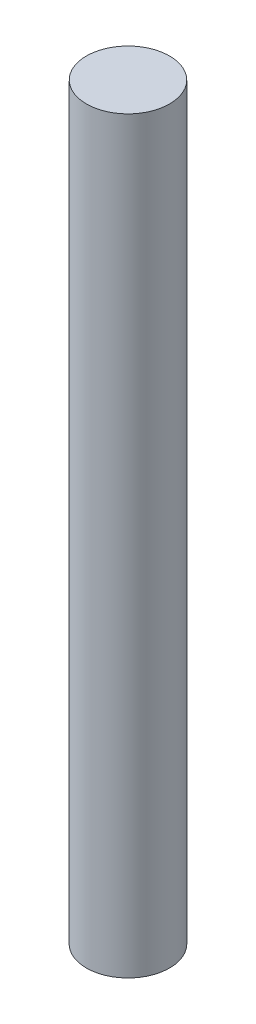
ISO-10303-21;
HEADER;
FILE_DESCRIPTION(('STEP AP214'),'2;1');
FILE_NAME('part.step','',(''),(''),'','','');
FILE_SCHEMA(('AUTOMOTIVE_DESIGN { 1 0 10303 214 1 1 1 1 }'));
ENDSEC;
DATA;
#1=APPLICATION_CONTEXT('core data for automotive mechanical design processes');
#2=APPLICATION_PROTOCOL_DEFINITION('international standard','automotive_design',2000,#1);
#3=PRODUCT_CONTEXT('',#1,'mechanical');
#4=PRODUCT('Part','Part','',(#3));
#5=PRODUCT_RELATED_PRODUCT_CATEGORY('part','',(#4));
#6=PRODUCT_DEFINITION_FORMATION('','',#4);
#7=PRODUCT_DEFINITION_CONTEXT('part definition',#1,'design');
#8=PRODUCT_DEFINITION('design','',#6,#7);
#9=PRODUCT_DEFINITION_SHAPE('','',#8);
#10=(LENGTH_UNIT() NAMED_UNIT(*) SI_UNIT(.MILLI.,.METRE.));
#11=(NAMED_UNIT(*) PLANE_ANGLE_UNIT() SI_UNIT($,.RADIAN.));
#12=(NAMED_UNIT(*) SI_UNIT($,.STERADIAN.) SOLID_ANGLE_UNIT());
#13=UNCERTAINTY_MEASURE_WITH_UNIT(LENGTH_MEASURE(1.E-05),#10,'distance_accuracy_value','');
#14=(GEOMETRIC_REPRESENTATION_CONTEXT(3) GLOBAL_UNCERTAINTY_ASSIGNED_CONTEXT((#13)) GLOBAL_UNIT_ASSIGNED_CONTEXT((#10,
#11,#12)) REPRESENTATION_CONTEXT('',''));
#15=CARTESIAN_POINT('',(0.,0.,0.));
#16=DIRECTION('',(0.,0.,1.));
#17=DIRECTION('',(1.,0.,0.));
#18=AXIS2_PLACEMENT_3D('',#15,#16,#17);
#19=CARTESIAN_POINT('',(0.,57.15,0.));
#20=DIRECTION('',(0.,-1.,0.));
#21=DIRECTION('',(0.,0.,-1.));
#22=AXIS2_PLACEMENT_3D('',#19,#20,#21);
#23=CYLINDRICAL_SURFACE('',#22,6.35);
#24=CARTESIAN_POINT('',(0.,57.15,0.));
#25=DIRECTION('',(0.,1.,0.));
#26=DIRECTION('',(0.,0.,1.));
#27=AXIS2_PLACEMENT_3D('',#24,#25,#26);
#28=CIRCLE('',#27,6.35);
#29=CARTESIAN_POINT('',(0.,57.15,6.35));
#30=VERTEX_POINT('',#29);
#31=EDGE_CURVE('E10',#30,#30,#28,.T.);
#32=ORIENTED_EDGE('',*,*,#31,.F.);
#33=EDGE_LOOP('',(#32));
#34=FACE_BOUND('',#33,.T.);
#35=CARTESIAN_POINT('',(0.,-57.15,0.));
#36=DIRECTION('',(0.,1.,0.));
#37=DIRECTION('',(0.,0.,1.));
#38=AXIS2_PLACEMENT_3D('',#35,#36,#37);
#39=CIRCLE('',#38,6.35);
#40=CARTESIAN_POINT('',(0.,-57.15,6.35));
#41=VERTEX_POINT('',#40);
#42=EDGE_CURVE('E46',#41,#41,#39,.T.);
#43=ORIENTED_EDGE('',*,*,#42,.T.);
#44=EDGE_LOOP('',(#43));
#45=FACE_BOUND('',#44,.T.);
#46=ADVANCED_FACE('F43',(#34,#45),#23,.T.);
#47=CARTESIAN_POINT('',(0.,57.15,0.));
#48=DIRECTION('',(0.,1.,0.));
#49=DIRECTION('',(0.,0.,1.));
#50=AXIS2_PLACEMENT_3D('',#47,#48,#49);
#51=PLANE('',#50);
#52=ORIENTED_EDGE('',*,*,#31,.T.);
#53=EDGE_LOOP('',(#52));
#54=FACE_BOUND('',#53,.T.);
#55=ADVANCED_FACE('F60',(#54),#51,.T.);
#56=CARTESIAN_POINT('',(0.,-57.15,0.));
#57=DIRECTION('',(0.,1.,0.));
#58=DIRECTION('',(0.,0.,1.));
#59=AXIS2_PLACEMENT_3D('',#56,#57,#58);
#60=PLANE('',#59);
#61=ORIENTED_EDGE('',*,*,#42,.F.);
#62=EDGE_LOOP('',(#61));
#63=FACE_BOUND('',#62,.T.);
#64=ADVANCED_FACE('F58',(#63),#60,.F.);
#65=CLOSED_SHELL('',(#46,#55,#64));
#66=MANIFOLD_SOLID_BREP('B2',#65);
#67=ADVANCED_BREP_SHAPE_REPRESENTATION('',(#18,#66),#14);
#68=SHAPE_DEFINITION_REPRESENTATION(#9,#67);
ENDSEC;
END-ISO-10303-21;
